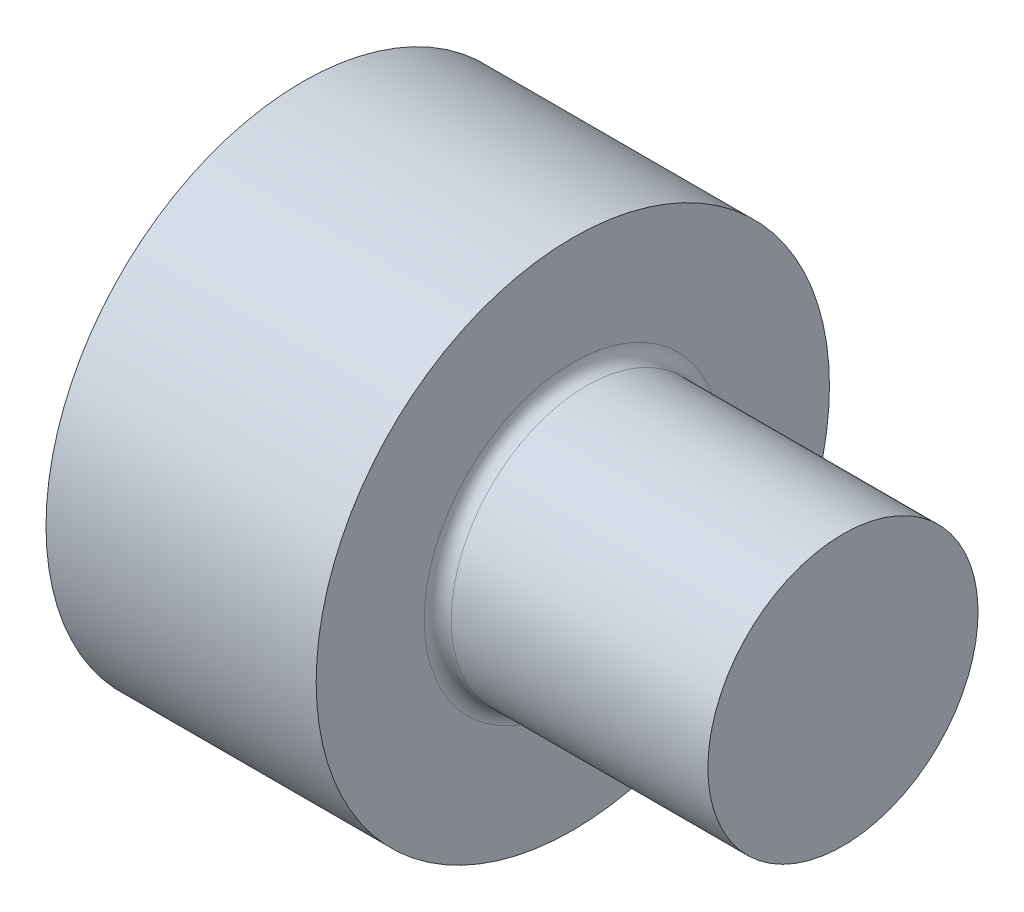
ISO-10303-21;
HEADER;
FILE_DESCRIPTION(('STEP AP214'),'2;1');
FILE_NAME('part.step','',(''),(''),'','','');
FILE_SCHEMA(('AUTOMOTIVE_DESIGN { 1 0 10303 214 1 1 1 1 }'));
ENDSEC;
DATA;
#1=APPLICATION_CONTEXT('core data for automotive mechanical design processes');
#2=APPLICATION_PROTOCOL_DEFINITION('international standard','automotive_design',2000,#1);
#3=PRODUCT_CONTEXT('',#1,'mechanical');
#4=PRODUCT('Part','Part','',(#3));
#5=PRODUCT_RELATED_PRODUCT_CATEGORY('part','',(#4));
#6=PRODUCT_DEFINITION_FORMATION('','',#4);
#7=PRODUCT_DEFINITION_CONTEXT('part definition',#1,'design');
#8=PRODUCT_DEFINITION('design','',#6,#7);
#9=PRODUCT_DEFINITION_SHAPE('','',#8);
#10=(LENGTH_UNIT() NAMED_UNIT(*) SI_UNIT(.MILLI.,.METRE.));
#11=(NAMED_UNIT(*) PLANE_ANGLE_UNIT() SI_UNIT($,.RADIAN.));
#12=(NAMED_UNIT(*) SI_UNIT($,.STERADIAN.) SOLID_ANGLE_UNIT());
#13=UNCERTAINTY_MEASURE_WITH_UNIT(LENGTH_MEASURE(1.E-05),#10,'distance_accuracy_value','');
#14=(GEOMETRIC_REPRESENTATION_CONTEXT(3) GLOBAL_UNCERTAINTY_ASSIGNED_CONTEXT((#13)) GLOBAL_UNIT_ASSIGNED_CONTEXT((#10,
#11,#12)) REPRESENTATION_CONTEXT('',''));
#15=CARTESIAN_POINT('',(0.,0.,0.));
#16=DIRECTION('',(0.,0.,1.));
#17=DIRECTION('',(1.,0.,0.));
#18=AXIS2_PLACEMENT_3D('',#15,#16,#17);
#19=CARTESIAN_POINT('',(0.,10.,0.));
#20=DIRECTION('',(1.,0.,0.));
#21=DIRECTION('',(0.,1.,0.));
#22=AXIS2_PLACEMENT_3D('',#19,#20,#21);
#23=PLANE('',#22);
#24=CARTESIAN_POINT('',(0.,0.,0.));
#25=DIRECTION('',(1.,0.,0.));
#26=DIRECTION('',(0.,1.,0.));
#27=AXIS2_PLACEMENT_3D('',#24,#25,#26);
#28=CIRCLE('',#27,10.);
#29=CARTESIAN_POINT('',(0.,10.,0.));
#30=VERTEX_POINT('',#29);
#31=EDGE_CURVE('E61',#30,#30,#28,.T.);
#32=ORIENTED_EDGE('',*,*,#31,.T.);
#33=EDGE_LOOP('',(#32));
#34=FACE_BOUND('',#33,.T.);
#35=ADVANCED_FACE('F37',(#34),#23,.T.);
#36=CARTESIAN_POINT('',(-40.,0.,0.));
#37=DIRECTION('',(-1.,0.,0.));
#38=DIRECTION('',(0.,-1.,0.));
#39=AXIS2_PLACEMENT_3D('',#36,#37,#38);
#40=PLANE('',#39);
#41=CARTESIAN_POINT('',(-40.,0.,0.));
#42=DIRECTION('',(1.,0.,0.));
#43=DIRECTION('',(0.,1.,0.));
#44=AXIS2_PLACEMENT_3D('',#41,#42,#43);
#45=CIRCLE('',#44,19.);
#46=CARTESIAN_POINT('',(-40.,19.,0.));
#47=VERTEX_POINT('',#46);
#48=EDGE_CURVE('E50',#47,#47,#45,.T.);
#49=ORIENTED_EDGE('',*,*,#48,.F.);
#50=EDGE_LOOP('',(#49));
#51=FACE_BOUND('',#50,.T.);
#52=ADVANCED_FACE('F79',(#51),#40,.T.);
#53=CARTESIAN_POINT('',(0.,0.,0.));
#54=DIRECTION('',(1.,0.,0.));
#55=DIRECTION('',(0.,1.,0.));
#56=AXIS2_PLACEMENT_3D('',#53,#54,#55);
#57=CYLINDRICAL_SURFACE('',#56,19.);
#58=ORIENTED_EDGE('',*,*,#48,.T.);
#59=EDGE_LOOP('',(#58));
#60=FACE_BOUND('',#59,.T.);
#61=CARTESIAN_POINT('',(-20.,0.,0.));
#62=DIRECTION('',(1.,0.,0.));
#63=DIRECTION('',(0.,1.,0.));
#64=AXIS2_PLACEMENT_3D('',#61,#62,#63);
#65=CIRCLE('',#64,19.);
#66=CARTESIAN_POINT('',(-20.,19.,0.));
#67=VERTEX_POINT('',#66);
#68=EDGE_CURVE('E55',#67,#67,#65,.T.);
#69=ORIENTED_EDGE('',*,*,#68,.F.);
#70=EDGE_LOOP('',(#69));
#71=FACE_BOUND('',#70,.T.);
#72=ADVANCED_FACE('F76',(#60,#71),#57,.T.);
#73=CARTESIAN_POINT('',(-20.,19.,0.));
#74=DIRECTION('',(1.,0.,0.));
#75=DIRECTION('',(0.,1.,0.));
#76=AXIS2_PLACEMENT_3D('',#73,#74,#75);
#77=PLANE('',#76);
#78=CARTESIAN_POINT('',(-20.,0.,0.));
#79=DIRECTION('',(1.,0.,0.));
#80=DIRECTION('',(0.,1.,0.));
#81=AXIS2_PLACEMENT_3D('',#78,#79,#80);
#82=CIRCLE('',#81,11.);
#83=CARTESIAN_POINT('',(-20.,11.,0.));
#84=VERTEX_POINT('',#83);
#85=EDGE_CURVE('E10',#84,#84,#82,.F.);
#86=ORIENTED_EDGE('',*,*,#85,.T.);
#87=EDGE_LOOP('',(#86));
#88=FACE_BOUND('',#87,.T.);
#89=ORIENTED_EDGE('',*,*,#68,.T.);
#90=EDGE_LOOP('',(#89));
#91=FACE_BOUND('',#90,.T.);
#92=ADVANCED_FACE('F69',(#88,#91),#77,.T.);
#93=CARTESIAN_POINT('',(0.,0.,0.));
#94=DIRECTION('',(1.,0.,0.));
#95=DIRECTION('',(0.,1.,0.));
#96=AXIS2_PLACEMENT_3D('',#93,#94,#95);
#97=CYLINDRICAL_SURFACE('',#96,10.);
#98=CARTESIAN_POINT('',(-19.,0.,0.));
#99=DIRECTION('',(1.,0.,0.));
#100=DIRECTION('',(0.,1.,0.));
#101=AXIS2_PLACEMENT_3D('',#98,#99,#100);
#102=CIRCLE('',#101,10.);
#103=CARTESIAN_POINT('',(-19.,10.,0.));
#104=VERTEX_POINT('',#103);
#105=EDGE_CURVE('E45',#104,#104,#102,.T.);
#106=ORIENTED_EDGE('',*,*,#105,.T.);
#107=EDGE_LOOP('',(#106));
#108=FACE_BOUND('',#107,.T.);
#109=ORIENTED_EDGE('',*,*,#31,.F.);
#110=EDGE_LOOP('',(#109));
#111=FACE_BOUND('',#110,.T.);
#112=ADVANCED_FACE('F67',(#108,#111),#97,.T.);
#113=CARTESIAN_POINT('',(-19.,0.,0.));
#114=DIRECTION('',(1.,0.,0.));
#115=DIRECTION('',(0.,1.,0.));
#116=AXIS2_PLACEMENT_3D('',#113,#114,#115);
#117=TOROIDAL_SURFACE('',#116,11.,1.);
#118=ORIENTED_EDGE('',*,*,#85,.F.);
#119=EDGE_LOOP('',(#118));
#120=FACE_BOUND('',#119,.T.);
#121=ORIENTED_EDGE('',*,*,#105,.F.);
#122=EDGE_LOOP('',(#121));
#123=FACE_BOUND('',#122,.T.);
#124=ADVANCED_FACE('F39',(#120,#123),#117,.F.);
#125=CLOSED_SHELL('',(#35,#52,#72,#92,#112,#124));
#126=MANIFOLD_SOLID_BREP('B2',#125);
#127=ADVANCED_BREP_SHAPE_REPRESENTATION('',(#18,#126),#14);
#128=SHAPE_DEFINITION_REPRESENTATION(#9,#127);
ENDSEC;
END-ISO-10303-21;
